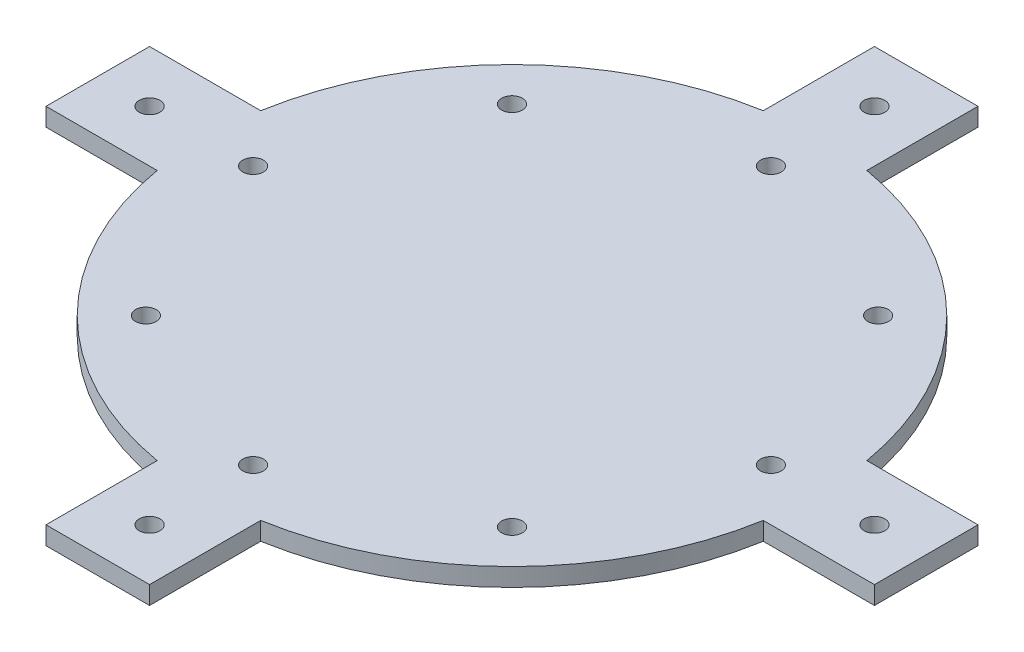
ISO-10303-21;
HEADER;
FILE_DESCRIPTION(('STEP AP214'),'2;1');
FILE_NAME('part.step','',(''),(''),'','','');
FILE_SCHEMA(('AUTOMOTIVE_DESIGN { 1 0 10303 214 1 1 1 1 }'));
ENDSEC;
DATA;
#1=APPLICATION_CONTEXT('core data for automotive mechanical design processes');
#2=APPLICATION_PROTOCOL_DEFINITION('international standard','automotive_design',2000,#1);
#3=PRODUCT_CONTEXT('',#1,'mechanical');
#4=PRODUCT('Part','Part','',(#3));
#5=PRODUCT_RELATED_PRODUCT_CATEGORY('part','',(#4));
#6=PRODUCT_DEFINITION_FORMATION('','',#4);
#7=PRODUCT_DEFINITION_CONTEXT('part definition',#1,'design');
#8=PRODUCT_DEFINITION('design','',#6,#7);
#9=PRODUCT_DEFINITION_SHAPE('','',#8);
#10=(LENGTH_UNIT() NAMED_UNIT(*) SI_UNIT(.MILLI.,.METRE.));
#11=(NAMED_UNIT(*) PLANE_ANGLE_UNIT() SI_UNIT($,.RADIAN.));
#12=(NAMED_UNIT(*) SI_UNIT($,.STERADIAN.) SOLID_ANGLE_UNIT());
#13=UNCERTAINTY_MEASURE_WITH_UNIT(LENGTH_MEASURE(1.E-05),#10,'distance_accuracy_value','');
#14=(GEOMETRIC_REPRESENTATION_CONTEXT(3) GLOBAL_UNCERTAINTY_ASSIGNED_CONTEXT((#13)) GLOBAL_UNIT_ASSIGNED_CONTEXT((#10,
#11,#12)) REPRESENTATION_CONTEXT('',''));
#15=CARTESIAN_POINT('',(0.,0.,0.));
#16=DIRECTION('',(0.,0.,1.));
#17=DIRECTION('',(1.,0.,0.));
#18=AXIS2_PLACEMENT_3D('',#15,#16,#17);
#19=CARTESIAN_POINT('',(-10.,3.5,-80.));
#20=DIRECTION('',(1.,0.,0.));
#21=DIRECTION('',(0.,0.,-1.));
#22=AXIS2_PLACEMENT_3D('',#19,#20,#21);
#23=PLANE('',#22);
#24=DIRECTION('',(0.,0.,1.));
#25=VECTOR('',#24,1.);
#26=CARTESIAN_POINT('',(-10.,0.,-80.));
#27=LINE('',#26,#25);
#28=CARTESIAN_POINT('',(-10.,0.,-80.));
#29=VERTEX_POINT('',#28);
#30=CARTESIAN_POINT('',(-9.99999999999997,0.,-58.5304135246494));
#31=VERTEX_POINT('',#30);
#32=EDGE_CURVE('E191',#29,#31,#27,.T.);
#33=ORIENTED_EDGE('',*,*,#32,.T.);
#34=DIRECTION('',(0.,-1.,0.));
#35=VECTOR('',#34,1.);
#36=CARTESIAN_POINT('',(-9.99999999999997,3.5,-58.5304135246494));
#37=LINE('',#36,#35);
#38=CARTESIAN_POINT('',(-9.99999999999997,3.5,-58.5304135246494));
#39=VERTEX_POINT('',#38);
#40=EDGE_CURVE('E11',#39,#31,#37,.T.);
#41=ORIENTED_EDGE('',*,*,#40,.F.);
#42=DIRECTION('',(0.,0.,1.));
#43=VECTOR('',#42,1.);
#44=CARTESIAN_POINT('',(-10.,3.5,-80.));
#45=LINE('',#44,#43);
#46=CARTESIAN_POINT('',(-10.,3.5,-80.));
#47=VERTEX_POINT('',#46);
#48=EDGE_CURVE('E247',#47,#39,#45,.T.);
#49=ORIENTED_EDGE('',*,*,#48,.F.);
#50=DIRECTION('',(0.,-1.,0.));
#51=VECTOR('',#50,1.);
#52=CARTESIAN_POINT('',(-10.,3.5,-80.));
#53=LINE('',#52,#51);
#54=EDGE_CURVE('E59',#47,#29,#53,.T.);
#55=ORIENTED_EDGE('',*,*,#54,.T.);
#56=EDGE_LOOP('',(#33,#41,#49,#55));
#57=FACE_BOUND('',#56,.T.);
#58=ADVANCED_FACE('F42',(#57),#23,.F.);
#59=CARTESIAN_POINT('',(0.,3.5,0.));
#60=DIRECTION('',(0.,-1.,0.));
#61=DIRECTION('',(0.,0.,-1.));
#62=AXIS2_PLACEMENT_3D('',#59,#60,#61);
#63=CYLINDRICAL_SURFACE('',#62,59.3785256415689);
#64=CARTESIAN_POINT('',(0.,0.,0.));
#65=DIRECTION('',(0.,1.,0.));
#66=DIRECTION('',(0.,0.,1.));
#67=AXIS2_PLACEMENT_3D('',#64,#65,#66);
#68=CIRCLE('',#67,59.3785256415689);
#69=CARTESIAN_POINT('',(-58.5304135246494,0.,-10.));
#70=VERTEX_POINT('',#69);
#71=EDGE_CURVE('E194',#31,#70,#68,.T.);
#72=ORIENTED_EDGE('',*,*,#71,.T.);
#73=DIRECTION('',(0.,-1.,0.));
#74=VECTOR('',#73,1.);
#75=CARTESIAN_POINT('',(-58.5304135246494,3.5,-10.));
#76=LINE('',#75,#74);
#77=CARTESIAN_POINT('',(-58.5304135246494,3.5,-10.));
#78=VERTEX_POINT('',#77);
#79=EDGE_CURVE('E51',#78,#70,#76,.T.);
#80=ORIENTED_EDGE('',*,*,#79,.F.);
#81=CARTESIAN_POINT('',(0.,3.5,0.));
#82=DIRECTION('',(0.,1.,0.));
#83=DIRECTION('',(0.,0.,1.));
#84=AXIS2_PLACEMENT_3D('',#81,#82,#83);
#85=CIRCLE('',#84,59.3785256415689);
#86=EDGE_CURVE('E121',#39,#78,#85,.T.);
#87=ORIENTED_EDGE('',*,*,#86,.F.);
#88=ORIENTED_EDGE('',*,*,#40,.T.);
#89=EDGE_LOOP('',(#72,#80,#87,#88));
#90=FACE_BOUND('',#89,.T.);
#91=ADVANCED_FACE('F295',(#90),#63,.T.);
#92=CARTESIAN_POINT('',(-80.,3.5,-10.));
#93=DIRECTION('',(0.,0.,-1.));
#94=DIRECTION('',(-1.,0.,0.));
#95=AXIS2_PLACEMENT_3D('',#92,#93,#94);
#96=PLANE('',#95);
#97=DIRECTION('',(1.,0.,0.));
#98=VECTOR('',#97,1.);
#99=CARTESIAN_POINT('',(-80.,0.,-10.));
#100=LINE('',#99,#98);
#101=CARTESIAN_POINT('',(-80.,0.,-10.));
#102=VERTEX_POINT('',#101);
#103=EDGE_CURVE('E199',#102,#70,#100,.T.);
#104=ORIENTED_EDGE('',*,*,#103,.F.);
#105=DIRECTION('',(0.,-1.,0.));
#106=VECTOR('',#105,1.);
#107=CARTESIAN_POINT('',(-80.,3.5,-10.));
#108=LINE('',#107,#106);
#109=CARTESIAN_POINT('',(-80.,3.5,-10.));
#110=VERTEX_POINT('',#109);
#111=EDGE_CURVE('E286',#110,#102,#108,.T.);
#112=ORIENTED_EDGE('',*,*,#111,.F.);
#113=DIRECTION('',(1.,0.,0.));
#114=VECTOR('',#113,1.);
#115=CARTESIAN_POINT('',(-80.,3.5,-10.));
#116=LINE('',#115,#114);
#117=EDGE_CURVE('E294',#110,#78,#116,.T.);
#118=ORIENTED_EDGE('',*,*,#117,.T.);
#119=ORIENTED_EDGE('',*,*,#79,.T.);
#120=EDGE_LOOP('',(#104,#112,#118,#119));
#121=FACE_BOUND('',#120,.T.);
#122=ADVANCED_FACE('F292',(#121),#96,.T.);
#123=CARTESIAN_POINT('',(-80.,3.5,10.));
#124=DIRECTION('',(-1.,0.,0.));
#125=DIRECTION('',(0.,0.,1.));
#126=AXIS2_PLACEMENT_3D('',#123,#124,#125);
#127=PLANE('',#126);
#128=DIRECTION('',(0.,0.,-1.));
#129=VECTOR('',#128,1.);
#130=CARTESIAN_POINT('',(-80.,0.,10.));
#131=LINE('',#130,#129);
#132=CARTESIAN_POINT('',(-80.,0.,10.));
#133=VERTEX_POINT('',#132);
#134=EDGE_CURVE('E203',#133,#102,#131,.T.);
#135=ORIENTED_EDGE('',*,*,#134,.F.);
#136=DIRECTION('',(0.,-1.,0.));
#137=VECTOR('',#136,1.);
#138=CARTESIAN_POINT('',(-80.,3.5,10.));
#139=LINE('',#138,#137);
#140=CARTESIAN_POINT('',(-80.,3.5,10.));
#141=VERTEX_POINT('',#140);
#142=EDGE_CURVE('E283',#141,#133,#139,.T.);
#143=ORIENTED_EDGE('',*,*,#142,.F.);
#144=DIRECTION('',(0.,0.,-1.));
#145=VECTOR('',#144,1.);
#146=CARTESIAN_POINT('',(-80.,3.5,10.));
#147=LINE('',#146,#145);
#148=EDGE_CURVE('E307',#141,#110,#147,.T.);
#149=ORIENTED_EDGE('',*,*,#148,.T.);
#150=ORIENTED_EDGE('',*,*,#111,.T.);
#151=EDGE_LOOP('',(#135,#143,#149,#150));
#152=FACE_BOUND('',#151,.T.);
#153=ADVANCED_FACE('F303',(#152),#127,.T.);
#154=CARTESIAN_POINT('',(-80.,3.5,10.));
#155=DIRECTION('',(0.,0.,-1.));
#156=DIRECTION('',(-1.,0.,0.));
#157=AXIS2_PLACEMENT_3D('',#154,#155,#156);
#158=PLANE('',#157);
#159=DIRECTION('',(1.,0.,0.));
#160=VECTOR('',#159,1.);
#161=CARTESIAN_POINT('',(-80.,0.,10.));
#162=LINE('',#161,#160);
#163=CARTESIAN_POINT('',(-58.5304135246494,0.,10.));
#164=VERTEX_POINT('',#163);
#165=EDGE_CURVE('E207',#133,#164,#162,.T.);
#166=ORIENTED_EDGE('',*,*,#165,.T.);
#167=DIRECTION('',(0.,-1.,0.));
#168=VECTOR('',#167,1.);
#169=CARTESIAN_POINT('',(-58.5304135246494,3.5,10.));
#170=LINE('',#169,#168);
#171=CARTESIAN_POINT('',(-58.5304135246494,3.5,10.));
#172=VERTEX_POINT('',#171);
#173=EDGE_CURVE('E279',#172,#164,#170,.T.);
#174=ORIENTED_EDGE('',*,*,#173,.F.);
#175=DIRECTION('',(1.,0.,0.));
#176=VECTOR('',#175,1.);
#177=CARTESIAN_POINT('',(-80.,3.5,10.));
#178=LINE('',#177,#176);
#179=EDGE_CURVE('E312',#141,#172,#178,.T.);
#180=ORIENTED_EDGE('',*,*,#179,.F.);
#181=ORIENTED_EDGE('',*,*,#142,.T.);
#182=EDGE_LOOP('',(#166,#174,#180,#181));
#183=FACE_BOUND('',#182,.T.);
#184=ADVANCED_FACE('F694',(#183),#158,.F.);
#185=CARTESIAN_POINT('',(0.,3.5,0.));
#186=DIRECTION('',(0.,-1.,0.));
#187=DIRECTION('',(0.,0.,-1.));
#188=AXIS2_PLACEMENT_3D('',#185,#186,#187);
#189=CYLINDRICAL_SURFACE('',#188,59.3785256415689);
#190=CARTESIAN_POINT('',(0.,0.,0.));
#191=DIRECTION('',(0.,1.,0.));
#192=DIRECTION('',(0.,0.,1.));
#193=AXIS2_PLACEMENT_3D('',#190,#191,#192);
#194=CIRCLE('',#193,59.3785256415689);
#195=CARTESIAN_POINT('',(-10.,0.,58.5304135246494));
#196=VERTEX_POINT('',#195);
#197=EDGE_CURVE('E210',#164,#196,#194,.T.);
#198=ORIENTED_EDGE('',*,*,#197,.T.);
#199=DIRECTION('',(0.,-1.,0.));
#200=VECTOR('',#199,1.);
#201=CARTESIAN_POINT('',(-10.,3.5,58.5304135246494));
#202=LINE('',#201,#200);
#203=CARTESIAN_POINT('',(-10.,3.5,58.5304135246494));
#204=VERTEX_POINT('',#203);
#205=EDGE_CURVE('E275',#204,#196,#202,.T.);
#206=ORIENTED_EDGE('',*,*,#205,.F.);
#207=CARTESIAN_POINT('',(0.,3.5,0.));
#208=DIRECTION('',(0.,1.,0.));
#209=DIRECTION('',(0.,0.,1.));
#210=AXIS2_PLACEMENT_3D('',#207,#208,#209);
#211=CIRCLE('',#210,59.3785256415689);
#212=EDGE_CURVE('E319',#172,#204,#211,.T.);
#213=ORIENTED_EDGE('',*,*,#212,.F.);
#214=ORIENTED_EDGE('',*,*,#173,.T.);
#215=EDGE_LOOP('',(#198,#206,#213,#214));
#216=FACE_BOUND('',#215,.T.);
#217=ADVANCED_FACE('F683',(#216),#189,.T.);
#218=CARTESIAN_POINT('',(-9.99999999999999,3.5,58.5304135246494));
#219=DIRECTION('',(1.,0.,0.));
#220=DIRECTION('',(0.,0.,-1.));
#221=AXIS2_PLACEMENT_3D('',#218,#219,#220);
#222=PLANE('',#221);
#223=DIRECTION('',(0.,0.,1.));
#224=VECTOR('',#223,1.);
#225=CARTESIAN_POINT('',(-9.99999999999999,0.,58.5304135246494));
#226=LINE('',#225,#224);
#227=CARTESIAN_POINT('',(-9.99999999999999,0.,80.));
#228=VERTEX_POINT('',#227);
#229=EDGE_CURVE('E213',#196,#228,#226,.T.);
#230=ORIENTED_EDGE('',*,*,#229,.T.);
#231=DIRECTION('',(0.,-1.,0.));
#232=VECTOR('',#231,1.);
#233=CARTESIAN_POINT('',(-9.99999999999999,3.5,80.));
#234=LINE('',#233,#232);
#235=CARTESIAN_POINT('',(-9.99999999999999,3.5,80.));
#236=VERTEX_POINT('',#235);
#237=EDGE_CURVE('E271',#236,#228,#234,.T.);
#238=ORIENTED_EDGE('',*,*,#237,.F.);
#239=DIRECTION('',(0.,0.,1.));
#240=VECTOR('',#239,1.);
#241=CARTESIAN_POINT('',(-9.99999999999999,3.5,58.5304135246494));
#242=LINE('',#241,#240);
#243=EDGE_CURVE('E322',#204,#236,#242,.T.);
#244=ORIENTED_EDGE('',*,*,#243,.F.);
#245=ORIENTED_EDGE('',*,*,#205,.T.);
#246=EDGE_LOOP('',(#230,#238,#244,#245));
#247=FACE_BOUND('',#246,.T.);
#248=ADVANCED_FACE('F672',(#247),#222,.F.);
#249=CARTESIAN_POINT('',(-9.99999999999999,3.5,80.));
#250=DIRECTION('',(0.,0.,-1.));
#251=DIRECTION('',(-1.,0.,0.));
#252=AXIS2_PLACEMENT_3D('',#249,#250,#251);
#253=PLANE('',#252);
#254=DIRECTION('',(1.,0.,0.));
#255=VECTOR('',#254,1.);
#256=CARTESIAN_POINT('',(-9.99999999999999,0.,80.));
#257=LINE('',#256,#255);
#258=CARTESIAN_POINT('',(10.,0.,80.));
#259=VERTEX_POINT('',#258);
#260=EDGE_CURVE('E216',#228,#259,#257,.T.);
#261=ORIENTED_EDGE('',*,*,#260,.T.);
#262=DIRECTION('',(0.,-1.,0.));
#263=VECTOR('',#262,1.);
#264=CARTESIAN_POINT('',(10.,3.5,80.));
#265=LINE('',#264,#263);
#266=CARTESIAN_POINT('',(10.,3.5,80.));
#267=VERTEX_POINT('',#266);
#268=EDGE_CURVE('E268',#267,#259,#265,.T.);
#269=ORIENTED_EDGE('',*,*,#268,.F.);
#270=DIRECTION('',(1.,0.,0.));
#271=VECTOR('',#270,1.);
#272=CARTESIAN_POINT('',(-9.99999999999999,3.5,80.));
#273=LINE('',#272,#271);
#274=EDGE_CURVE('E325',#236,#267,#273,.T.);
#275=ORIENTED_EDGE('',*,*,#274,.F.);
#276=ORIENTED_EDGE('',*,*,#237,.T.);
#277=EDGE_LOOP('',(#261,#269,#275,#276));
#278=FACE_BOUND('',#277,.T.);
#279=ADVANCED_FACE('F661',(#278),#253,.F.);
#280=CARTESIAN_POINT('',(10.,3.5,58.5304135246494));
#281=DIRECTION('',(1.,0.,0.));
#282=DIRECTION('',(0.,0.,-1.));
#283=AXIS2_PLACEMENT_3D('',#280,#281,#282);
#284=PLANE('',#283);
#285=DIRECTION('',(0.,0.,1.));
#286=VECTOR('',#285,1.);
#287=CARTESIAN_POINT('',(10.,0.,58.5304135246494));
#288=LINE('',#287,#286);
#289=CARTESIAN_POINT('',(10.,0.,58.5304135246494));
#290=VERTEX_POINT('',#289);
#291=EDGE_CURVE('E220',#290,#259,#288,.T.);
#292=ORIENTED_EDGE('',*,*,#291,.F.);
#293=DIRECTION('',(0.,-1.,0.));
#294=VECTOR('',#293,1.);
#295=CARTESIAN_POINT('',(10.,3.5,58.5304135246494));
#296=LINE('',#295,#294);
#297=CARTESIAN_POINT('',(10.,3.5,58.5304135246494));
#298=VERTEX_POINT('',#297);
#299=EDGE_CURVE('E265',#298,#290,#296,.T.);
#300=ORIENTED_EDGE('',*,*,#299,.F.);
#301=DIRECTION('',(0.,0.,1.));
#302=VECTOR('',#301,1.);
#303=CARTESIAN_POINT('',(10.,3.5,58.5304135246494));
#304=LINE('',#303,#302);
#305=EDGE_CURVE('E328',#298,#267,#304,.T.);
#306=ORIENTED_EDGE('',*,*,#305,.T.);
#307=ORIENTED_EDGE('',*,*,#268,.T.);
#308=EDGE_LOOP('',(#292,#300,#306,#307));
#309=FACE_BOUND('',#308,.T.);
#310=ADVANCED_FACE('F650',(#309),#284,.T.);
#311=CARTESIAN_POINT('',(0.,3.5,0.));
#312=DIRECTION('',(0.,-1.,0.));
#313=DIRECTION('',(0.,0.,-1.));
#314=AXIS2_PLACEMENT_3D('',#311,#312,#313);
#315=CYLINDRICAL_SURFACE('',#314,59.3785256415689);
#316=CARTESIAN_POINT('',(0.,0.,0.));
#317=DIRECTION('',(0.,1.,0.));
#318=DIRECTION('',(0.,0.,1.));
#319=AXIS2_PLACEMENT_3D('',#316,#317,#318);
#320=CIRCLE('',#319,59.3785256415689);
#321=CARTESIAN_POINT('',(58.5304135246494,0.,10.));
#322=VERTEX_POINT('',#321);
#323=EDGE_CURVE('E224',#290,#322,#320,.T.);
#324=ORIENTED_EDGE('',*,*,#323,.T.);
#325=DIRECTION('',(0.,-1.,0.));
#326=VECTOR('',#325,1.);
#327=CARTESIAN_POINT('',(58.5304135246494,3.5,10.));
#328=LINE('',#327,#326);
#329=CARTESIAN_POINT('',(58.5304135246494,3.5,10.));
#330=VERTEX_POINT('',#329);
#331=EDGE_CURVE('E261',#330,#322,#328,.T.);
#332=ORIENTED_EDGE('',*,*,#331,.F.);
#333=CARTESIAN_POINT('',(0.,3.5,0.));
#334=DIRECTION('',(0.,1.,0.));
#335=DIRECTION('',(0.,0.,1.));
#336=AXIS2_PLACEMENT_3D('',#333,#334,#335);
#337=CIRCLE('',#336,59.3785256415689);
#338=EDGE_CURVE('E332',#298,#330,#337,.T.);
#339=ORIENTED_EDGE('',*,*,#338,.F.);
#340=ORIENTED_EDGE('',*,*,#299,.T.);
#341=EDGE_LOOP('',(#324,#332,#339,#340));
#342=FACE_BOUND('',#341,.T.);
#343=ADVANCED_FACE('F639',(#342),#315,.T.);
#344=CARTESIAN_POINT('',(58.5304135246494,3.5,10.));
#345=DIRECTION('',(0.,0.,-1.));
#346=DIRECTION('',(-1.,0.,0.));
#347=AXIS2_PLACEMENT_3D('',#344,#345,#346);
#348=PLANE('',#347);
#349=DIRECTION('',(1.,0.,0.));
#350=VECTOR('',#349,1.);
#351=CARTESIAN_POINT('',(58.5304135246494,0.,10.));
#352=LINE('',#351,#350);
#353=CARTESIAN_POINT('',(80.,0.,10.));
#354=VERTEX_POINT('',#353);
#355=EDGE_CURVE('E227',#322,#354,#352,.T.);
#356=ORIENTED_EDGE('',*,*,#355,.T.);
#357=DIRECTION('',(0.,-1.,0.));
#358=VECTOR('',#357,1.);
#359=CARTESIAN_POINT('',(80.,3.5,10.));
#360=LINE('',#359,#358);
#361=CARTESIAN_POINT('',(80.,3.5,10.));
#362=VERTEX_POINT('',#361);
#363=EDGE_CURVE('E257',#362,#354,#360,.T.);
#364=ORIENTED_EDGE('',*,*,#363,.F.);
#365=DIRECTION('',(1.,0.,0.));
#366=VECTOR('',#365,1.);
#367=CARTESIAN_POINT('',(58.5304135246494,3.5,10.));
#368=LINE('',#367,#366);
#369=EDGE_CURVE('E335',#330,#362,#368,.T.);
#370=ORIENTED_EDGE('',*,*,#369,.F.);
#371=ORIENTED_EDGE('',*,*,#331,.T.);
#372=EDGE_LOOP('',(#356,#364,#370,#371));
#373=FACE_BOUND('',#372,.T.);
#374=ADVANCED_FACE('F628',(#373),#348,.F.);
#375=CARTESIAN_POINT('',(80.,3.5,10.));
#376=DIRECTION('',(-1.,0.,0.));
#377=DIRECTION('',(0.,0.,1.));
#378=AXIS2_PLACEMENT_3D('',#375,#376,#377);
#379=PLANE('',#378);
#380=DIRECTION('',(0.,0.,-1.));
#381=VECTOR('',#380,1.);
#382=CARTESIAN_POINT('',(80.,0.,10.));
#383=LINE('',#382,#381);
#384=CARTESIAN_POINT('',(80.,0.,-10.));
#385=VERTEX_POINT('',#384);
#386=EDGE_CURVE('E230',#354,#385,#383,.T.);
#387=ORIENTED_EDGE('',*,*,#386,.T.);
#388=DIRECTION('',(0.,-1.,0.));
#389=VECTOR('',#388,1.);
#390=CARTESIAN_POINT('',(80.,3.5,-10.));
#391=LINE('',#390,#389);
#392=CARTESIAN_POINT('',(80.,3.5,-10.));
#393=VERTEX_POINT('',#392);
#394=EDGE_CURVE('E254',#393,#385,#391,.T.);
#395=ORIENTED_EDGE('',*,*,#394,.F.);
#396=DIRECTION('',(0.,0.,-1.));
#397=VECTOR('',#396,1.);
#398=CARTESIAN_POINT('',(80.,3.5,10.));
#399=LINE('',#398,#397);
#400=EDGE_CURVE('E338',#362,#393,#399,.T.);
#401=ORIENTED_EDGE('',*,*,#400,.F.);
#402=ORIENTED_EDGE('',*,*,#363,.T.);
#403=EDGE_LOOP('',(#387,#395,#401,#402));
#404=FACE_BOUND('',#403,.T.);
#405=ADVANCED_FACE('F618',(#404),#379,.F.);
#406=CARTESIAN_POINT('',(58.5304135246494,3.5,-10.));
#407=DIRECTION('',(0.,0.,-1.));
#408=DIRECTION('',(-1.,0.,0.));
#409=AXIS2_PLACEMENT_3D('',#406,#407,#408);
#410=PLANE('',#409);
#411=DIRECTION('',(1.,0.,0.));
#412=VECTOR('',#411,1.);
#413=CARTESIAN_POINT('',(58.5304135246494,0.,-10.));
#414=LINE('',#413,#412);
#415=CARTESIAN_POINT('',(58.5304135246494,0.,-10.));
#416=VERTEX_POINT('',#415);
#417=EDGE_CURVE('E234',#416,#385,#414,.T.);
#418=ORIENTED_EDGE('',*,*,#417,.F.);
#419=DIRECTION('',(0.,-1.,0.));
#420=VECTOR('',#419,1.);
#421=CARTESIAN_POINT('',(58.5304135246494,3.5,-10.));
#422=LINE('',#421,#420);
#423=CARTESIAN_POINT('',(58.5304135246494,3.5,-10.));
#424=VERTEX_POINT('',#423);
#425=EDGE_CURVE('E181',#424,#416,#422,.T.);
#426=ORIENTED_EDGE('',*,*,#425,.F.);
#427=DIRECTION('',(1.,0.,0.));
#428=VECTOR('',#427,1.);
#429=CARTESIAN_POINT('',(58.5304135246494,3.5,-10.));
#430=LINE('',#429,#428);
#431=EDGE_CURVE('E169',#424,#393,#430,.T.);
#432=ORIENTED_EDGE('',*,*,#431,.T.);
#433=ORIENTED_EDGE('',*,*,#394,.T.);
#434=EDGE_LOOP('',(#418,#426,#432,#433));
#435=FACE_BOUND('',#434,.T.);
#436=ADVANCED_FACE('F343',(#435),#410,.T.);
#437=CARTESIAN_POINT('',(0.,3.5,0.));
#438=DIRECTION('',(0.,-1.,0.));
#439=DIRECTION('',(0.,0.,-1.));
#440=AXIS2_PLACEMENT_3D('',#437,#438,#439);
#441=CYLINDRICAL_SURFACE('',#440,59.3785256415689);
#442=CARTESIAN_POINT('',(0.,0.,0.));
#443=DIRECTION('',(0.,1.,0.));
#444=DIRECTION('',(0.,0.,1.));
#445=AXIS2_PLACEMENT_3D('',#442,#443,#444);
#446=CIRCLE('',#445,59.3785256415689);
#447=CARTESIAN_POINT('',(10.,0.,-58.5304135246494));
#448=VERTEX_POINT('',#447);
#449=EDGE_CURVE('E177',#416,#448,#446,.T.);
#450=ORIENTED_EDGE('',*,*,#449,.T.);
#451=DIRECTION('',(0.,-1.,0.));
#452=VECTOR('',#451,1.);
#453=CARTESIAN_POINT('',(10.,3.5,-58.5304135246494));
#454=LINE('',#453,#452);
#455=CARTESIAN_POINT('',(10.,3.5,-58.5304135246494));
#456=VERTEX_POINT('',#455);
#457=EDGE_CURVE('E174',#456,#448,#454,.T.);
#458=ORIENTED_EDGE('',*,*,#457,.F.);
#459=CARTESIAN_POINT('',(0.,3.5,0.));
#460=DIRECTION('',(0.,1.,0.));
#461=DIRECTION('',(0.,0.,1.));
#462=AXIS2_PLACEMENT_3D('',#459,#460,#461);
#463=CIRCLE('',#462,59.3785256415689);
#464=EDGE_CURVE('E162',#424,#456,#463,.T.);
#465=ORIENTED_EDGE('',*,*,#464,.F.);
#466=ORIENTED_EDGE('',*,*,#425,.T.);
#467=EDGE_LOOP('',(#450,#458,#465,#466));
#468=FACE_BOUND('',#467,.T.);
#469=ADVANCED_FACE('F175',(#468),#441,.T.);
#470=CARTESIAN_POINT('',(9.99999999999999,3.5,-80.));
#471=DIRECTION('',(1.,0.,0.));
#472=DIRECTION('',(0.,0.,-1.));
#473=AXIS2_PLACEMENT_3D('',#470,#471,#472);
#474=PLANE('',#473);
#475=DIRECTION('',(0.,0.,1.));
#476=VECTOR('',#475,1.);
#477=CARTESIAN_POINT('',(9.99999999999999,0.,-80.));
#478=LINE('',#477,#476);
#479=CARTESIAN_POINT('',(9.99999999999999,0.,-80.));
#480=VERTEX_POINT('',#479);
#481=EDGE_CURVE('E240',#480,#448,#478,.T.);
#482=ORIENTED_EDGE('',*,*,#481,.F.);
#483=DIRECTION('',(0.,-1.,0.));
#484=VECTOR('',#483,1.);
#485=CARTESIAN_POINT('',(9.99999999999999,3.5,-80.));
#486=LINE('',#485,#484);
#487=CARTESIAN_POINT('',(9.99999999999999,3.5,-80.));
#488=VERTEX_POINT('',#487);
#489=EDGE_CURVE('E109',#488,#480,#486,.T.);
#490=ORIENTED_EDGE('',*,*,#489,.F.);
#491=DIRECTION('',(0.,0.,1.));
#492=VECTOR('',#491,1.);
#493=CARTESIAN_POINT('',(9.99999999999999,3.5,-80.));
#494=LINE('',#493,#492);
#495=EDGE_CURVE('E167',#488,#456,#494,.T.);
#496=ORIENTED_EDGE('',*,*,#495,.T.);
#497=ORIENTED_EDGE('',*,*,#457,.T.);
#498=EDGE_LOOP('',(#482,#490,#496,#497));
#499=FACE_BOUND('',#498,.T.);
#500=ADVANCED_FACE('F183',(#499),#474,.T.);
#501=CARTESIAN_POINT('',(-10.,3.5,-80.));
#502=DIRECTION('',(0.,0.,-1.));
#503=DIRECTION('',(-1.,0.,0.));
#504=AXIS2_PLACEMENT_3D('',#501,#502,#503);
#505=PLANE('',#504);
#506=DIRECTION('',(1.,0.,0.));
#507=VECTOR('',#506,1.);
#508=CARTESIAN_POINT('',(-10.,0.,-80.));
#509=LINE('',#508,#507);
#510=EDGE_CURVE('E243',#29,#480,#509,.T.);
#511=ORIENTED_EDGE('',*,*,#510,.F.);
#512=ORIENTED_EDGE('',*,*,#54,.F.);
#513=DIRECTION('',(1.,0.,0.));
#514=VECTOR('',#513,1.);
#515=CARTESIAN_POINT('',(-10.,3.5,-80.));
#516=LINE('',#515,#514);
#517=EDGE_CURVE('E185',#47,#488,#516,.T.);
#518=ORIENTED_EDGE('',*,*,#517,.T.);
#519=ORIENTED_EDGE('',*,*,#489,.T.);
#520=EDGE_LOOP('',(#511,#512,#518,#519));
#521=FACE_BOUND('',#520,.T.);
#522=ADVANCED_FACE('F346',(#521),#505,.T.);
#523=CARTESIAN_POINT('',(0.,3.5,0.));
#524=DIRECTION('',(0.,1.,0.));
#525=DIRECTION('',(0.,0.,1.));
#526=AXIS2_PLACEMENT_3D('',#523,#524,#525);
#527=PLANE('',#526);
#528=CARTESIAN_POINT('',(0.,3.5,-70.));
#529=DIRECTION('',(0.,1.,0.));
#530=DIRECTION('',(0.,0.,1.));
#531=AXIS2_PLACEMENT_3D('',#528,#529,#530);
#532=CIRCLE('',#531,2.00000000000334);
#533=CARTESIAN_POINT('',(0.,3.5,-67.9999999999967));
#534=VERTEX_POINT('',#533);
#535=EDGE_CURVE('E448',#534,#534,#532,.T.);
#536=ORIENTED_EDGE('',*,*,#535,.F.);
#537=EDGE_LOOP('',(#536));
#538=FACE_BOUND('',#537,.T.);
#539=CARTESIAN_POINT('',(70.0000000000015,3.5,-1.55400916767861E-12));
#540=DIRECTION('',(0.,1.,0.));
#541=DIRECTION('',(0.,0.,1.));
#542=AXIS2_PLACEMENT_3D('',#539,#540,#541);
#543=CIRCLE('',#542,2.00000000000333);
#544=CARTESIAN_POINT('',(70.0000000000015,3.5,2.00000000000178));
#545=VERTEX_POINT('',#544);
#546=EDGE_CURVE('E444',#545,#545,#543,.T.);
#547=ORIENTED_EDGE('',*,*,#546,.F.);
#548=EDGE_LOOP('',(#547));
#549=FACE_BOUND('',#548,.T.);
#550=CARTESIAN_POINT('',(3.10801833535723E-12,3.5,70.));
#551=DIRECTION('',(0.,1.,0.));
#552=DIRECTION('',(0.,0.,1.));
#553=AXIS2_PLACEMENT_3D('',#550,#551,#552);
#554=CIRCLE('',#553,2.00000000000334);
#555=CARTESIAN_POINT('',(3.10801833535723E-12,3.5,72.0000000000033));
#556=VERTEX_POINT('',#555);
#557=EDGE_CURVE('E436',#556,#556,#554,.T.);
#558=ORIENTED_EDGE('',*,*,#557,.F.);
#559=EDGE_LOOP('',(#558));
#560=FACE_BOUND('',#559,.T.);
#561=CARTESIAN_POINT('',(-69.9999999999985,3.5,1.56258169527265E-12));
#562=DIRECTION('',(0.,1.,0.));
#563=DIRECTION('',(0.,0.,1.));
#564=AXIS2_PLACEMENT_3D('',#561,#562,#563);
#565=CIRCLE('',#564,2.00000000000335);
#566=CARTESIAN_POINT('',(-69.9999999999985,3.5,2.00000000000491));
#567=VERTEX_POINT('',#566);
#568=EDGE_CURVE('E427',#567,#567,#565,.T.);
#569=ORIENTED_EDGE('',*,*,#568,.F.);
#570=EDGE_LOOP('',(#569));
#571=FACE_BOUND('',#570,.T.);
#572=CARTESIAN_POINT('',(-50.,3.5,1.74574066942157E-13));
#573=DIRECTION('',(0.,1.,0.));
#574=DIRECTION('',(1.,0.,0.));
#575=AXIS2_PLACEMENT_3D('',#572,#573,#574);
#576=CIRCLE('',#575,2.);
#577=CARTESIAN_POINT('',(-48.,3.5,1.6759110426447E-13));
#578=VERTEX_POINT('',#577);
#579=EDGE_CURVE('E401',#578,#578,#576,.T.);
#580=ORIENTED_EDGE('',*,*,#579,.F.);
#581=EDGE_LOOP('',(#580));
#582=FACE_BOUND('',#581,.T.);
#583=CARTESIAN_POINT('',(-35.3553390593272,3.5,35.3553390593276));
#584=DIRECTION('',(0.,1.,0.));
#585=DIRECTION('',(0.707106781186544,0.,-0.707106781186551));
#586=AXIS2_PLACEMENT_3D('',#583,#584,#585);
#587=CIRCLE('',#586,2.);
#588=CARTESIAN_POINT('',(-33.9411254969541,3.5,33.9411254969545));
#589=VERTEX_POINT('',#588);
#590=EDGE_CURVE('E393',#589,#589,#587,.T.);
#591=ORIENTED_EDGE('',*,*,#590,.F.);
#592=EDGE_LOOP('',(#591));
#593=FACE_BOUND('',#592,.T.);
#594=CARTESIAN_POINT('',(0.,3.5,50.));
#595=DIRECTION('',(0.,1.,0.));
#596=DIRECTION('',(0.,0.,-1.));
#597=AXIS2_PLACEMENT_3D('',#594,#595,#596);
#598=CIRCLE('',#597,2.);
#599=CARTESIAN_POINT('',(0.,3.5,48.));
#600=VERTEX_POINT('',#599);
#601=EDGE_CURVE('E383',#600,#600,#598,.T.);
#602=ORIENTED_EDGE('',*,*,#601,.F.);
#603=EDGE_LOOP('',(#602));
#604=FACE_BOUND('',#603,.T.);
#605=CARTESIAN_POINT('',(35.3553390593277,3.5,35.3553390593271));
#606=DIRECTION('',(0.,1.,0.));
#607=DIRECTION('',(-0.707106781186554,0.,-0.707106781186541));
#608=AXIS2_PLACEMENT_3D('',#605,#606,#607);
#609=CIRCLE('',#608,2.);
#610=CARTESIAN_POINT('',(33.9411254969546,3.5,33.941125496954));
#611=VERTEX_POINT('',#610);
#612=EDGE_CURVE('E384',#611,#611,#609,.T.);
#613=ORIENTED_EDGE('',*,*,#612,.F.);
#614=EDGE_LOOP('',(#613));
#615=FACE_BOUND('',#614,.T.);
#616=CARTESIAN_POINT('',(50.,3.5,-5.2372220082647E-13));
#617=DIRECTION('',(0.,1.,0.));
#618=DIRECTION('',(-1.,0.,0.));
#619=AXIS2_PLACEMENT_3D('',#616,#617,#618);
#620=CIRCLE('',#619,2.);
#621=CARTESIAN_POINT('',(48.,3.5,-5.02773312793411E-13));
#622=VERTEX_POINT('',#621);
#623=EDGE_CURVE('E415',#622,#622,#620,.T.);
#624=ORIENTED_EDGE('',*,*,#623,.F.);
#625=EDGE_LOOP('',(#624));
#626=FACE_BOUND('',#625,.T.);
#627=CARTESIAN_POINT('',(35.3553390593269,3.5,-35.3553390593278));
#628=DIRECTION('',(0.,1.,0.));
#629=DIRECTION('',(-0.707106781186539,0.,0.707106781186556));
#630=AXIS2_PLACEMENT_3D('',#627,#628,#629);
#631=CIRCLE('',#630,2.);
#632=CARTESIAN_POINT('',(33.9411254969539,3.5,-33.9411254969547));
#633=VERTEX_POINT('',#632);
#634=EDGE_CURVE('E416',#633,#633,#631,.T.);
#635=ORIENTED_EDGE('',*,*,#634,.F.);
#636=EDGE_LOOP('',(#635));
#637=FACE_BOUND('',#636,.T.);
#638=CARTESIAN_POINT('',(-35.3553390593274,3.5,-35.3553390593273));
#639=DIRECTION('',(0.,1.,0.));
#640=DIRECTION('',(0.707106781186549,0.,0.707106781186546));
#641=AXIS2_PLACEMENT_3D('',#638,#639,#640);
#642=CIRCLE('',#641,2.);
#643=CARTESIAN_POINT('',(-33.9411254969543,3.5,-33.9411254969542));
#644=VERTEX_POINT('',#643);
#645=EDGE_CURVE('E374',#644,#644,#642,.T.);
#646=ORIENTED_EDGE('',*,*,#645,.F.);
#647=EDGE_LOOP('',(#646));
#648=FACE_BOUND('',#647,.T.);
#649=CARTESIAN_POINT('',(0.,3.5,-50.));
#650=DIRECTION('',(0.,1.,0.));
#651=DIRECTION('',(0.,0.,1.));
#652=AXIS2_PLACEMENT_3D('',#649,#650,#651);
#653=CIRCLE('',#652,2.);
#654=CARTESIAN_POINT('',(0.,3.5,-48.));
#655=VERTEX_POINT('',#654);
#656=EDGE_CURVE('E366',#655,#655,#653,.T.);
#657=ORIENTED_EDGE('',*,*,#656,.F.);
#658=EDGE_LOOP('',(#657));
#659=FACE_BOUND('',#658,.T.);
#660=ORIENTED_EDGE('',*,*,#48,.T.);
#661=ORIENTED_EDGE('',*,*,#86,.T.);
#662=ORIENTED_EDGE('',*,*,#117,.F.);
#663=ORIENTED_EDGE('',*,*,#148,.F.);
#664=ORIENTED_EDGE('',*,*,#179,.T.);
#665=ORIENTED_EDGE('',*,*,#212,.T.);
#666=ORIENTED_EDGE('',*,*,#243,.T.);
#667=ORIENTED_EDGE('',*,*,#274,.T.);
#668=ORIENTED_EDGE('',*,*,#305,.F.);
#669=ORIENTED_EDGE('',*,*,#338,.T.);
#670=ORIENTED_EDGE('',*,*,#369,.T.);
#671=ORIENTED_EDGE('',*,*,#400,.T.);
#672=ORIENTED_EDGE('',*,*,#431,.F.);
#673=ORIENTED_EDGE('',*,*,#464,.T.);
#674=ORIENTED_EDGE('',*,*,#495,.F.);
#675=ORIENTED_EDGE('',*,*,#517,.F.);
#676=EDGE_LOOP('',(#660,#661,#662,#663,#664,#665,#666,#667,#668,#669,#670,#671,#672,#673,#674,#675));
#677=FACE_BOUND('',#676,.T.);
#678=ADVANCED_FACE('F164',(#538,#549,#560,#571,#582,#593,#604,#615,#626,#637,#648,#659,#677),
#527,.T.);
#679=CARTESIAN_POINT('',(0.,0.,0.));
#680=DIRECTION('',(0.,1.,0.));
#681=DIRECTION('',(0.,0.,1.));
#682=AXIS2_PLACEMENT_3D('',#679,#680,#681);
#683=PLANE('',#682);
#684=CARTESIAN_POINT('',(0.,0.,-70.));
#685=DIRECTION('',(0.,1.,0.));
#686=DIRECTION('',(0.,0.,1.));
#687=AXIS2_PLACEMENT_3D('',#684,#685,#686);
#688=CIRCLE('',#687,2.00000000000334);
#689=CARTESIAN_POINT('',(0.,0.,-67.9999999999967));
#690=VERTEX_POINT('',#689);
#691=EDGE_CURVE('E420',#690,#690,#688,.F.);
#692=ORIENTED_EDGE('',*,*,#691,.F.);
#693=EDGE_LOOP('',(#692));
#694=FACE_BOUND('',#693,.T.);
#695=CARTESIAN_POINT('',(70.0000000000015,0.,-1.55400916767861E-12));
#696=DIRECTION('',(0.,1.,0.));
#697=DIRECTION('',(0.,0.,1.));
#698=AXIS2_PLACEMENT_3D('',#695,#696,#697);
#699=CIRCLE('',#698,2.00000000000333);
#700=CARTESIAN_POINT('',(70.0000000000015,0.,2.00000000000178));
#701=VERTEX_POINT('',#700);
#702=EDGE_CURVE('E440',#701,#701,#699,.F.);
#703=ORIENTED_EDGE('',*,*,#702,.F.);
#704=EDGE_LOOP('',(#703));
#705=FACE_BOUND('',#704,.T.);
#706=CARTESIAN_POINT('',(3.10801833535723E-12,0.,70.));
#707=DIRECTION('',(0.,1.,0.));
#708=DIRECTION('',(0.,0.,1.));
#709=AXIS2_PLACEMENT_3D('',#706,#707,#708);
#710=CIRCLE('',#709,2.00000000000334);
#711=CARTESIAN_POINT('',(3.10801833535723E-12,0.,72.0000000000033));
#712=VERTEX_POINT('',#711);
#713=EDGE_CURVE('E431',#712,#712,#710,.F.);
#714=ORIENTED_EDGE('',*,*,#713,.F.);
#715=EDGE_LOOP('',(#714));
#716=FACE_BOUND('',#715,.T.);
#717=CARTESIAN_POINT('',(-69.9999999999985,0.,1.56258169527265E-12));
#718=DIRECTION('',(0.,1.,0.));
#719=DIRECTION('',(0.,0.,1.));
#720=AXIS2_PLACEMENT_3D('',#717,#718,#719);
#721=CIRCLE('',#720,2.00000000000335);
#722=CARTESIAN_POINT('',(-69.9999999999985,0.,2.00000000000491));
#723=VERTEX_POINT('',#722);
#724=EDGE_CURVE('E432',#723,#723,#721,.F.);
#725=ORIENTED_EDGE('',*,*,#724,.F.);
#726=EDGE_LOOP('',(#725));
#727=FACE_BOUND('',#726,.T.);
#728=CARTESIAN_POINT('',(-50.,0.,1.74574066942157E-13));
#729=DIRECTION('',(0.,1.,0.));
#730=DIRECTION('',(0.,0.,1.));
#731=AXIS2_PLACEMENT_3D('',#728,#729,#730);
#732=CIRCLE('',#731,2.);
#733=CARTESIAN_POINT('',(-50.,0.,2.00000000000018));
#734=VERTEX_POINT('',#733);
#735=EDGE_CURVE('E378',#734,#734,#732,.F.);
#736=ORIENTED_EDGE('',*,*,#735,.F.);
#737=EDGE_LOOP('',(#736));
#738=FACE_BOUND('',#737,.T.);
#739=CARTESIAN_POINT('',(-35.3553390593272,0.,35.3553390593276));
#740=DIRECTION('',(0.,1.,0.));
#741=DIRECTION('',(0.,0.,1.));
#742=AXIS2_PLACEMENT_3D('',#739,#740,#741);
#743=CIRCLE('',#742,2.);
#744=CARTESIAN_POINT('',(-35.3553390593272,0.,37.3553390593276));
#745=VERTEX_POINT('',#744);
#746=EDGE_CURVE('E397',#745,#745,#743,.F.);
#747=ORIENTED_EDGE('',*,*,#746,.F.);
#748=EDGE_LOOP('',(#747));
#749=FACE_BOUND('',#748,.T.);
#750=CARTESIAN_POINT('',(0.,0.,50.));
#751=DIRECTION('',(0.,1.,0.));
#752=DIRECTION('',(0.,0.,1.));
#753=AXIS2_PLACEMENT_3D('',#750,#751,#752);
#754=CIRCLE('',#753,2.);
#755=CARTESIAN_POINT('',(0.,0.,52.));
#756=VERTEX_POINT('',#755);
#757=EDGE_CURVE('E389',#756,#756,#754,.F.);
#758=ORIENTED_EDGE('',*,*,#757,.F.);
#759=EDGE_LOOP('',(#758));
#760=FACE_BOUND('',#759,.T.);
#761=CARTESIAN_POINT('',(35.3553390593277,0.,35.3553390593271));
#762=DIRECTION('',(0.,1.,0.));
#763=DIRECTION('',(0.,0.,1.));
#764=AXIS2_PLACEMENT_3D('',#761,#762,#763);
#765=CIRCLE('',#764,2.);
#766=CARTESIAN_POINT('',(35.3553390593277,0.,37.3553390593271));
#767=VERTEX_POINT('',#766);
#768=EDGE_CURVE('E379',#767,#767,#765,.F.);
#769=ORIENTED_EDGE('',*,*,#768,.F.);
#770=EDGE_LOOP('',(#769));
#771=FACE_BOUND('',#770,.T.);
#772=CARTESIAN_POINT('',(50.,0.,-5.2372220082647E-13));
#773=DIRECTION('',(0.,1.,0.));
#774=DIRECTION('',(0.,0.,1.));
#775=AXIS2_PLACEMENT_3D('',#772,#773,#774);
#776=CIRCLE('',#775,2.);
#777=CARTESIAN_POINT('',(50.,0.,1.99999999999948));
#778=VERTEX_POINT('',#777);
#779=EDGE_CURVE('E388',#778,#778,#776,.F.);
#780=ORIENTED_EDGE('',*,*,#779,.F.);
#781=EDGE_LOOP('',(#780));
#782=FACE_BOUND('',#781,.T.);
#783=CARTESIAN_POINT('',(35.3553390593269,0.,-35.3553390593278));
#784=DIRECTION('',(0.,1.,0.));
#785=DIRECTION('',(0.,0.,1.));
#786=AXIS2_PLACEMENT_3D('',#783,#784,#785);
#787=CIRCLE('',#786,2.);
#788=CARTESIAN_POINT('',(35.3553390593269,0.,-33.3553390593278));
#789=VERTEX_POINT('',#788);
#790=EDGE_CURVE('E411',#789,#789,#787,.F.);
#791=ORIENTED_EDGE('',*,*,#790,.F.);
#792=EDGE_LOOP('',(#791));
#793=FACE_BOUND('',#792,.T.);
#794=CARTESIAN_POINT('',(-35.3553390593274,0.,-35.3553390593273));
#795=DIRECTION('',(0.,1.,0.));
#796=DIRECTION('',(0.,0.,1.));
#797=AXIS2_PLACEMENT_3D('',#794,#795,#796);
#798=CIRCLE('',#797,2.);
#799=CARTESIAN_POINT('',(-35.3553390593274,0.,-33.3553390593273));
#800=VERTEX_POINT('',#799);
#801=EDGE_CURVE('E370',#800,#800,#798,.F.);
#802=ORIENTED_EDGE('',*,*,#801,.F.);
#803=EDGE_LOOP('',(#802));
#804=FACE_BOUND('',#803,.T.);
#805=CARTESIAN_POINT('',(0.,0.,-50.));
#806=DIRECTION('',(0.,1.,0.));
#807=DIRECTION('',(0.,0.,1.));
#808=AXIS2_PLACEMENT_3D('',#805,#806,#807);
#809=CIRCLE('',#808,2.);
#810=CARTESIAN_POINT('',(0.,0.,-48.));
#811=VERTEX_POINT('',#810);
#812=EDGE_CURVE('E195',#811,#811,#809,.F.);
#813=ORIENTED_EDGE('',*,*,#812,.F.);
#814=EDGE_LOOP('',(#813));
#815=FACE_BOUND('',#814,.T.);
#816=ORIENTED_EDGE('',*,*,#32,.F.);
#817=ORIENTED_EDGE('',*,*,#510,.T.);
#818=ORIENTED_EDGE('',*,*,#481,.T.);
#819=ORIENTED_EDGE('',*,*,#449,.F.);
#820=ORIENTED_EDGE('',*,*,#417,.T.);
#821=ORIENTED_EDGE('',*,*,#386,.F.);
#822=ORIENTED_EDGE('',*,*,#355,.F.);
#823=ORIENTED_EDGE('',*,*,#323,.F.);
#824=ORIENTED_EDGE('',*,*,#291,.T.);
#825=ORIENTED_EDGE('',*,*,#260,.F.);
#826=ORIENTED_EDGE('',*,*,#229,.F.);
#827=ORIENTED_EDGE('',*,*,#197,.F.);
#828=ORIENTED_EDGE('',*,*,#165,.F.);
#829=ORIENTED_EDGE('',*,*,#134,.T.);
#830=ORIENTED_EDGE('',*,*,#103,.T.);
#831=ORIENTED_EDGE('',*,*,#71,.F.);
#832=EDGE_LOOP('',(#816,#817,#818,#819,#820,#821,#822,#823,#824,#825,#826,#827,#828,#829,#830,#831));
#833=FACE_BOUND('',#832,.T.);
#834=ADVANCED_FACE('F298',(#694,#705,#716,#727,#738,#749,#760,#771,#782,#793,#804,#815,#833),
#683,.F.);
#835=CARTESIAN_POINT('',(0.,-0.00100000000000013,-50.));
#836=DIRECTION('',(0.,1.,0.));
#837=DIRECTION('',(0.,0.,1.));
#838=AXIS2_PLACEMENT_3D('',#835,#836,#837);
#839=CYLINDRICAL_SURFACE('',#838,2.);
#840=ORIENTED_EDGE('',*,*,#656,.T.);
#841=EDGE_LOOP('',(#840));
#842=FACE_BOUND('',#841,.T.);
#843=ORIENTED_EDGE('',*,*,#812,.T.);
#844=EDGE_LOOP('',(#843));
#845=FACE_BOUND('',#844,.T.);
#846=ADVANCED_FACE('F484',(#842,#845),#839,.F.);
#847=CARTESIAN_POINT('',(-35.3553390593274,-0.00100000000000013,-35.3553390593273));
#848=DIRECTION('',(0.,1.,0.));
#849=DIRECTION('',(0.,0.,1.));
#850=AXIS2_PLACEMENT_3D('',#847,#848,#849);
#851=CYLINDRICAL_SURFACE('',#850,2.);
#852=ORIENTED_EDGE('',*,*,#645,.T.);
#853=EDGE_LOOP('',(#852));
#854=FACE_BOUND('',#853,.T.);
#855=ORIENTED_EDGE('',*,*,#801,.T.);
#856=EDGE_LOOP('',(#855));
#857=FACE_BOUND('',#856,.T.);
#858=ADVANCED_FACE('F487',(#854,#857),#851,.F.);
#859=CARTESIAN_POINT('',(35.3553390593269,-0.00100000000000013,-35.3553390593278));
#860=DIRECTION('',(0.,1.,0.));
#861=DIRECTION('',(0.,0.,1.));
#862=AXIS2_PLACEMENT_3D('',#859,#860,#861);
#863=CYLINDRICAL_SURFACE('',#862,2.);
#864=ORIENTED_EDGE('',*,*,#634,.T.);
#865=EDGE_LOOP('',(#864));
#866=FACE_BOUND('',#865,.T.);
#867=ORIENTED_EDGE('',*,*,#790,.T.);
#868=EDGE_LOOP('',(#867));
#869=FACE_BOUND('',#868,.T.);
#870=ADVANCED_FACE('F500',(#866,#869),#863,.F.);
#871=CARTESIAN_POINT('',(50.,-0.00100000000000013,-5.2372220082647E-13));
#872=DIRECTION('',(0.,1.,0.));
#873=DIRECTION('',(0.,0.,1.));
#874=AXIS2_PLACEMENT_3D('',#871,#872,#873);
#875=CYLINDRICAL_SURFACE('',#874,2.);
#876=ORIENTED_EDGE('',*,*,#623,.T.);
#877=EDGE_LOOP('',(#876));
#878=FACE_BOUND('',#877,.T.);
#879=ORIENTED_EDGE('',*,*,#779,.T.);
#880=EDGE_LOOP('',(#879));
#881=FACE_BOUND('',#880,.T.);
#882=ADVANCED_FACE('F506',(#878,#881),#875,.F.);
#883=CARTESIAN_POINT('',(35.3553390593277,-0.00100000000000013,35.3553390593271));
#884=DIRECTION('',(0.,1.,0.));
#885=DIRECTION('',(0.,0.,1.));
#886=AXIS2_PLACEMENT_3D('',#883,#884,#885);
#887=CYLINDRICAL_SURFACE('',#886,2.);
#888=ORIENTED_EDGE('',*,*,#612,.T.);
#889=EDGE_LOOP('',(#888));
#890=FACE_BOUND('',#889,.T.);
#891=ORIENTED_EDGE('',*,*,#768,.T.);
#892=EDGE_LOOP('',(#891));
#893=FACE_BOUND('',#892,.T.);
#894=ADVANCED_FACE('F502',(#890,#893),#887,.F.);
#895=CARTESIAN_POINT('',(0.,-0.00100000000000013,50.));
#896=DIRECTION('',(0.,1.,0.));
#897=DIRECTION('',(0.,0.,1.));
#898=AXIS2_PLACEMENT_3D('',#895,#896,#897);
#899=CYLINDRICAL_SURFACE('',#898,2.);
#900=ORIENTED_EDGE('',*,*,#601,.T.);
#901=EDGE_LOOP('',(#900));
#902=FACE_BOUND('',#901,.T.);
#903=ORIENTED_EDGE('',*,*,#757,.T.);
#904=EDGE_LOOP('',(#903));
#905=FACE_BOUND('',#904,.T.);
#906=ADVANCED_FACE('F505',(#902,#905),#899,.F.);
#907=CARTESIAN_POINT('',(-35.3553390593272,-0.00100000000000013,35.3553390593276));
#908=DIRECTION('',(0.,1.,0.));
#909=DIRECTION('',(0.,0.,1.));
#910=AXIS2_PLACEMENT_3D('',#907,#908,#909);
#911=CYLINDRICAL_SURFACE('',#910,2.);
#912=ORIENTED_EDGE('',*,*,#590,.T.);
#913=EDGE_LOOP('',(#912));
#914=FACE_BOUND('',#913,.T.);
#915=ORIENTED_EDGE('',*,*,#746,.T.);
#916=EDGE_LOOP('',(#915));
#917=FACE_BOUND('',#916,.T.);
#918=ADVANCED_FACE('F510',(#914,#917),#911,.F.);
#919=CARTESIAN_POINT('',(-50.,-0.00100000000000013,1.74574066942157E-13));
#920=DIRECTION('',(0.,1.,0.));
#921=DIRECTION('',(0.,0.,1.));
#922=AXIS2_PLACEMENT_3D('',#919,#920,#921);
#923=CYLINDRICAL_SURFACE('',#922,2.);
#924=ORIENTED_EDGE('',*,*,#579,.T.);
#925=EDGE_LOOP('',(#924));
#926=FACE_BOUND('',#925,.T.);
#927=ORIENTED_EDGE('',*,*,#735,.T.);
#928=EDGE_LOOP('',(#927));
#929=FACE_BOUND('',#928,.T.);
#930=ADVANCED_FACE('F514',(#926,#929),#923,.F.);
#931=CARTESIAN_POINT('',(-69.9999999999985,-0.00100000000000013,1.56258169527265E-12));
#932=DIRECTION('',(0.,1.,0.));
#933=DIRECTION('',(0.,0.,1.));
#934=AXIS2_PLACEMENT_3D('',#931,#932,#933);
#935=CYLINDRICAL_SURFACE('',#934,2.00000000000335);
#936=ORIENTED_EDGE('',*,*,#568,.T.);
#937=EDGE_LOOP('',(#936));
#938=FACE_BOUND('',#937,.T.);
#939=ORIENTED_EDGE('',*,*,#724,.T.);
#940=EDGE_LOOP('',(#939));
#941=FACE_BOUND('',#940,.T.);
#942=ADVANCED_FACE('F518',(#938,#941),#935,.F.);
#943=CARTESIAN_POINT('',(3.10801833535723E-12,-0.00100000000000013,70.));
#944=DIRECTION('',(0.,1.,0.));
#945=DIRECTION('',(0.,0.,1.));
#946=AXIS2_PLACEMENT_3D('',#943,#944,#945);
#947=CYLINDRICAL_SURFACE('',#946,2.00000000000334);
#948=ORIENTED_EDGE('',*,*,#557,.T.);
#949=EDGE_LOOP('',(#948));
#950=FACE_BOUND('',#949,.T.);
#951=ORIENTED_EDGE('',*,*,#713,.T.);
#952=EDGE_LOOP('',(#951));
#953=FACE_BOUND('',#952,.T.);
#954=ADVANCED_FACE('F528',(#950,#953),#947,.F.);
#955=CARTESIAN_POINT('',(70.0000000000015,-0.00100000000000013,-1.55400916767861E-12));
#956=DIRECTION('',(0.,1.,0.));
#957=DIRECTION('',(0.,0.,1.));
#958=AXIS2_PLACEMENT_3D('',#955,#956,#957);
#959=CYLINDRICAL_SURFACE('',#958,2.00000000000333);
#960=ORIENTED_EDGE('',*,*,#546,.T.);
#961=EDGE_LOOP('',(#960));
#962=FACE_BOUND('',#961,.T.);
#963=ORIENTED_EDGE('',*,*,#702,.T.);
#964=EDGE_LOOP('',(#963));
#965=FACE_BOUND('',#964,.T.);
#966=ADVANCED_FACE('F532',(#962,#965),#959,.F.);
#967=CARTESIAN_POINT('',(0.,-0.00100000000000013,-70.));
#968=DIRECTION('',(0.,1.,0.));
#969=DIRECTION('',(0.,0.,1.));
#970=AXIS2_PLACEMENT_3D('',#967,#968,#969);
#971=CYLINDRICAL_SURFACE('',#970,2.00000000000334);
#972=ORIENTED_EDGE('',*,*,#535,.T.);
#973=EDGE_LOOP('',(#972));
#974=FACE_BOUND('',#973,.T.);
#975=ORIENTED_EDGE('',*,*,#691,.T.);
#976=EDGE_LOOP('',(#975));
#977=FACE_BOUND('',#976,.T.);
#978=ADVANCED_FACE('F459',(#974,#977),#971,.F.);
#979=CLOSED_SHELL('',(#58,#91,#122,#153,#184,#217,#248,#279,#310,#343,#374,#405,#436,#469,#500,
#522,#678,#834,#846,#858,#870,#882,#894,#906,#918,#930,#942,#954,#966,#978));
#980=MANIFOLD_SOLID_BREP('B2',#979);
#981=ADVANCED_BREP_SHAPE_REPRESENTATION('',(#18,#980),#14);
#982=SHAPE_DEFINITION_REPRESENTATION(#9,#981);
ENDSEC;
END-ISO-10303-21;
